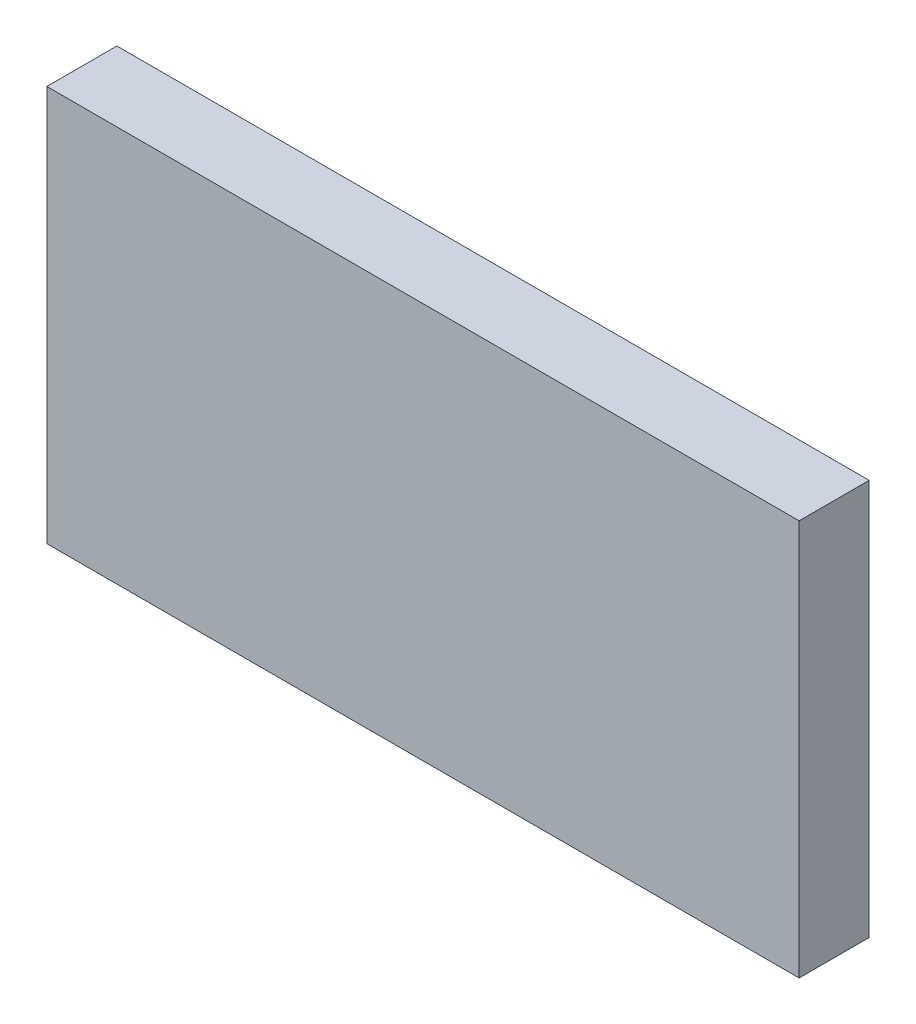
ISO-10303-21;
HEADER;
FILE_DESCRIPTION(('STEP AP214'),'2;1');
FILE_NAME('part.step','',(''),(''),'','','');
FILE_SCHEMA(('AUTOMOTIVE_DESIGN { 1 0 10303 214 1 1 1 1 }'));
ENDSEC;
DATA;
#1=APPLICATION_CONTEXT('core data for automotive mechanical design processes');
#2=APPLICATION_PROTOCOL_DEFINITION('international standard','automotive_design',2000,#1);
#3=PRODUCT_CONTEXT('',#1,'mechanical');
#4=PRODUCT('Part','Part','',(#3));
#5=PRODUCT_RELATED_PRODUCT_CATEGORY('part','',(#4));
#6=PRODUCT_DEFINITION_FORMATION('','',#4);
#7=PRODUCT_DEFINITION_CONTEXT('part definition',#1,'design');
#8=PRODUCT_DEFINITION('design','',#6,#7);
#9=PRODUCT_DEFINITION_SHAPE('','',#8);
#10=(LENGTH_UNIT() NAMED_UNIT(*) SI_UNIT(.MILLI.,.METRE.));
#11=(NAMED_UNIT(*) PLANE_ANGLE_UNIT() SI_UNIT($,.RADIAN.));
#12=(NAMED_UNIT(*) SI_UNIT($,.STERADIAN.) SOLID_ANGLE_UNIT());
#13=UNCERTAINTY_MEASURE_WITH_UNIT(LENGTH_MEASURE(1.E-05),#10,'distance_accuracy_value','');
#14=(GEOMETRIC_REPRESENTATION_CONTEXT(3) GLOBAL_UNCERTAINTY_ASSIGNED_CONTEXT((#13)) GLOBAL_UNIT_ASSIGNED_CONTEXT((#10,
#11,#12)) REPRESENTATION_CONTEXT('',''));
#15=CARTESIAN_POINT('',(0.,0.,0.));
#16=DIRECTION('',(0.,0.,1.));
#17=DIRECTION('',(1.,0.,0.));
#18=AXIS2_PLACEMENT_3D('',#15,#16,#17);
#19=CARTESIAN_POINT('',(77.0901411927961,-48.9937420986094,23.));
#20=DIRECTION('',(-1.,0.,0.));
#21=DIRECTION('',(0.,0.,1.));
#22=AXIS2_PLACEMENT_3D('',#19,#20,#21);
#23=PLANE('',#22);
#24=DIRECTION('',(0.,1.,0.));
#25=VECTOR('',#24,1.);
#26=CARTESIAN_POINT('',(77.0901411927961,-48.9937420986094,0.));
#27=LINE('',#26,#25);
#28=CARTESIAN_POINT('',(77.0901411927961,-48.9937420986094,0.));
#29=VERTEX_POINT('',#28);
#30=CARTESIAN_POINT('',(77.0901411927961,81.0062579013906,0.));
#31=VERTEX_POINT('',#30);
#32=EDGE_CURVE('E96',#29,#31,#27,.T.);
#33=ORIENTED_EDGE('',*,*,#32,.T.);
#34=DIRECTION('',(0.,0.,-1.));
#35=VECTOR('',#34,1.);
#36=CARTESIAN_POINT('',(77.0901411927961,81.0062579013906,23.));
#37=LINE('',#36,#35);
#38=CARTESIAN_POINT('',(77.0901411927961,81.0062579013906,23.));
#39=VERTEX_POINT('',#38);
#40=EDGE_CURVE('E11',#39,#31,#37,.T.);
#41=ORIENTED_EDGE('',*,*,#40,.F.);
#42=DIRECTION('',(0.,1.,0.));
#43=VECTOR('',#42,1.);
#44=CARTESIAN_POINT('',(77.0901411927961,-48.9937420986094,23.));
#45=LINE('',#44,#43);
#46=CARTESIAN_POINT('',(77.0901411927961,-48.9937420986094,23.));
#47=VERTEX_POINT('',#46);
#48=EDGE_CURVE('E84',#47,#39,#45,.T.);
#49=ORIENTED_EDGE('',*,*,#48,.F.);
#50=DIRECTION('',(0.,0.,-1.));
#51=VECTOR('',#50,1.);
#52=CARTESIAN_POINT('',(77.0901411927961,-48.9937420986094,23.));
#53=LINE('',#52,#51);
#54=EDGE_CURVE('E92',#47,#29,#53,.T.);
#55=ORIENTED_EDGE('',*,*,#54,.T.);
#56=EDGE_LOOP('',(#33,#41,#49,#55));
#57=FACE_BOUND('',#56,.T.);
#58=ADVANCED_FACE('F33',(#57),#23,.F.);
#59=CARTESIAN_POINT('',(-169.909858807204,81.0062579013906,23.));
#60=DIRECTION('',(0.,-1.,0.));
#61=DIRECTION('',(0.,0.,-1.));
#62=AXIS2_PLACEMENT_3D('',#59,#60,#61);
#63=PLANE('',#62);
#64=DIRECTION('',(-1.,0.,0.));
#65=VECTOR('',#64,1.);
#66=CARTESIAN_POINT('',(-169.909858807204,81.0062579013906,0.));
#67=LINE('',#66,#65);
#68=CARTESIAN_POINT('',(-169.909858807204,81.0062579013906,0.));
#69=VERTEX_POINT('',#68);
#70=EDGE_CURVE('E88',#31,#69,#67,.T.);
#71=ORIENTED_EDGE('',*,*,#70,.T.);
#72=DIRECTION('',(0.,0.,-1.));
#73=VECTOR('',#72,1.);
#74=CARTESIAN_POINT('',(-169.909858807204,81.0062579013906,23.));
#75=LINE('',#74,#73);
#76=CARTESIAN_POINT('',(-169.909858807204,81.0062579013906,23.));
#77=VERTEX_POINT('',#76);
#78=EDGE_CURVE('E41',#77,#69,#75,.T.);
#79=ORIENTED_EDGE('',*,*,#78,.F.);
#80=DIRECTION('',(-1.,0.,0.));
#81=VECTOR('',#80,1.);
#82=CARTESIAN_POINT('',(-169.909858807204,81.0062579013906,23.));
#83=LINE('',#82,#81);
#84=EDGE_CURVE('E79',#39,#77,#83,.T.);
#85=ORIENTED_EDGE('',*,*,#84,.F.);
#86=ORIENTED_EDGE('',*,*,#40,.T.);
#87=EDGE_LOOP('',(#71,#79,#85,#86));
#88=FACE_BOUND('',#87,.T.);
#89=ADVANCED_FACE('F87',(#88),#63,.F.);
#90=CARTESIAN_POINT('',(-169.909858807204,-48.9937420986094,23.));
#91=DIRECTION('',(1.,0.,0.));
#92=DIRECTION('',(0.,0.,-1.));
#93=AXIS2_PLACEMENT_3D('',#90,#91,#92);
#94=PLANE('',#93);
#95=DIRECTION('',(0.,-1.,0.));
#96=VECTOR('',#95,1.);
#97=CARTESIAN_POINT('',(-169.909858807204,-48.9937420986094,0.));
#98=LINE('',#97,#96);
#99=CARTESIAN_POINT('',(-169.909858807204,-48.9937420986094,0.));
#100=VERTEX_POINT('',#99);
#101=EDGE_CURVE('E66',#69,#100,#98,.T.);
#102=ORIENTED_EDGE('',*,*,#101,.T.);
#103=DIRECTION('',(0.,0.,-1.));
#104=VECTOR('',#103,1.);
#105=CARTESIAN_POINT('',(-169.909858807204,-48.9937420986094,23.));
#106=LINE('',#105,#104);
#107=CARTESIAN_POINT('',(-169.909858807204,-48.9937420986094,23.));
#108=VERTEX_POINT('',#107);
#109=EDGE_CURVE('E89',#108,#100,#106,.T.);
#110=ORIENTED_EDGE('',*,*,#109,.F.);
#111=DIRECTION('',(0.,-1.,0.));
#112=VECTOR('',#111,1.);
#113=CARTESIAN_POINT('',(-169.909858807204,-48.9937420986094,23.));
#114=LINE('',#113,#112);
#115=EDGE_CURVE('E82',#77,#108,#114,.T.);
#116=ORIENTED_EDGE('',*,*,#115,.F.);
#117=ORIENTED_EDGE('',*,*,#78,.T.);
#118=EDGE_LOOP('',(#102,#110,#116,#117));
#119=FACE_BOUND('',#118,.T.);
#120=ADVANCED_FACE('F90',(#119),#94,.F.);
#121=CARTESIAN_POINT('',(-169.909858807204,-48.9937420986094,23.));
#122=DIRECTION('',(0.,1.,0.));
#123=DIRECTION('',(0.,0.,1.));
#124=AXIS2_PLACEMENT_3D('',#121,#122,#123);
#125=PLANE('',#124);
#126=DIRECTION('',(1.,0.,0.));
#127=VECTOR('',#126,1.);
#128=CARTESIAN_POINT('',(-169.909858807204,-48.9937420986094,0.));
#129=LINE('',#128,#127);
#130=EDGE_CURVE('E72',#100,#29,#129,.T.);
#131=ORIENTED_EDGE('',*,*,#130,.T.);
#132=ORIENTED_EDGE('',*,*,#54,.F.);
#133=DIRECTION('',(1.,0.,0.));
#134=VECTOR('',#133,1.);
#135=CARTESIAN_POINT('',(-169.909858807204,-48.9937420986094,23.));
#136=LINE('',#135,#134);
#137=EDGE_CURVE('E49',#108,#47,#136,.T.);
#138=ORIENTED_EDGE('',*,*,#137,.F.);
#139=ORIENTED_EDGE('',*,*,#109,.T.);
#140=EDGE_LOOP('',(#131,#132,#138,#139));
#141=FACE_BOUND('',#140,.T.);
#142=ADVANCED_FACE('F103',(#141),#125,.F.);
#143=CARTESIAN_POINT('',(0.,0.,23.));
#144=DIRECTION('',(0.,0.,-1.));
#145=DIRECTION('',(-1.,0.,0.));
#146=AXIS2_PLACEMENT_3D('',#143,#144,#145);
#147=PLANE('',#146);
#148=ORIENTED_EDGE('',*,*,#48,.T.);
#149=ORIENTED_EDGE('',*,*,#84,.T.);
#150=ORIENTED_EDGE('',*,*,#115,.T.);
#151=ORIENTED_EDGE('',*,*,#137,.T.);
#152=EDGE_LOOP('',(#148,#149,#150,#151));
#153=FACE_BOUND('',#152,.T.);
#154=ADVANCED_FACE('F80',(#153),#147,.F.);
#155=CARTESIAN_POINT('',(0.,0.,0.));
#156=DIRECTION('',(0.,0.,-1.));
#157=DIRECTION('',(-1.,0.,0.));
#158=AXIS2_PLACEMENT_3D('',#155,#156,#157);
#159=PLANE('',#158);
#160=ORIENTED_EDGE('',*,*,#32,.F.);
#161=ORIENTED_EDGE('',*,*,#130,.F.);
#162=ORIENTED_EDGE('',*,*,#101,.F.);
#163=ORIENTED_EDGE('',*,*,#70,.F.);
#164=EDGE_LOOP('',(#160,#161,#162,#163));
#165=FACE_BOUND('',#164,.T.);
#166=ADVANCED_FACE('F106',(#165),#159,.T.);
#167=CLOSED_SHELL('',(#58,#89,#120,#142,#154,#166));
#168=MANIFOLD_SOLID_BREP('B2',#167);
#169=ADVANCED_BREP_SHAPE_REPRESENTATION('',(#18,#168),#14);
#170=SHAPE_DEFINITION_REPRESENTATION(#9,#169);
ENDSEC;
END-ISO-10303-21;
